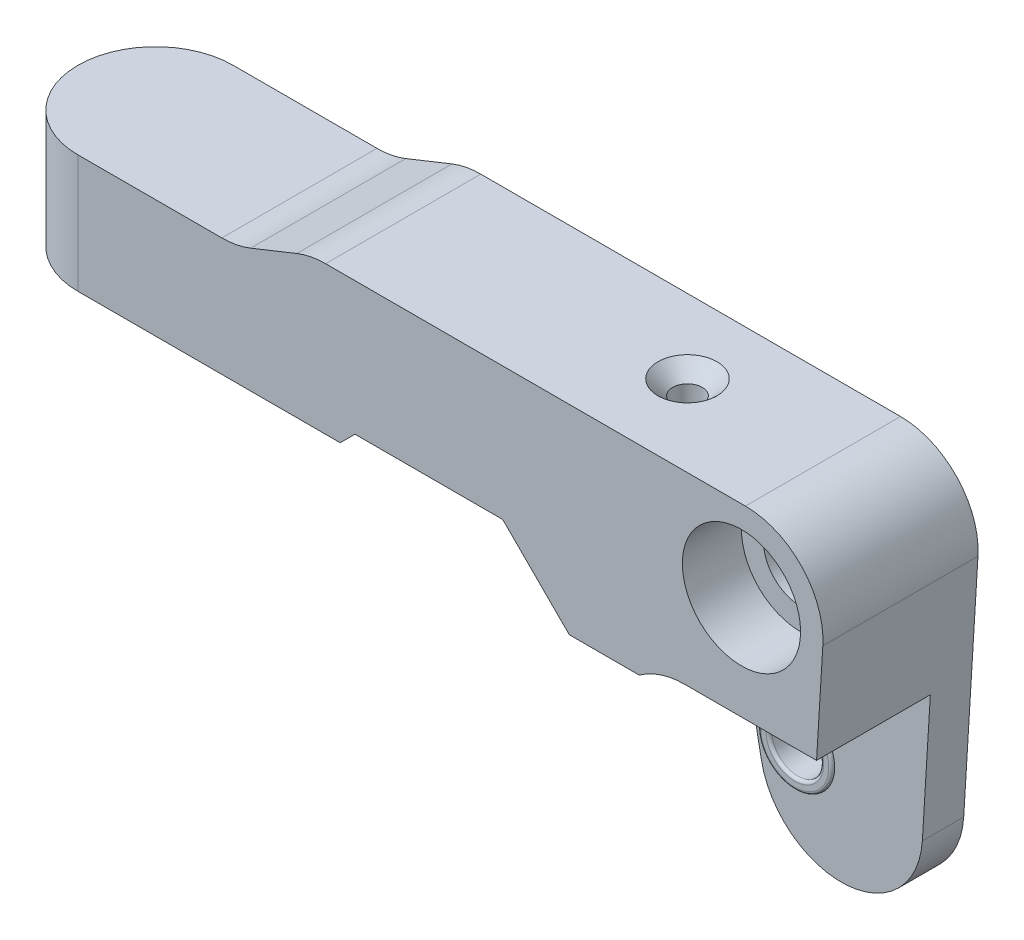
ISO-10303-21;
HEADER;
FILE_DESCRIPTION(('STEP AP214'),'2;1');
FILE_NAME('part.step','',(''),(''),'','','');
FILE_SCHEMA(('AUTOMOTIVE_DESIGN { 1 0 10303 214 1 1 1 1 }'));
ENDSEC;
DATA;
#1=APPLICATION_CONTEXT('core data for automotive mechanical design processes');
#2=APPLICATION_PROTOCOL_DEFINITION('international standard','automotive_design',2000,#1);
#3=PRODUCT_CONTEXT('',#1,'mechanical');
#4=PRODUCT('Part','Part','',(#3));
#5=PRODUCT_RELATED_PRODUCT_CATEGORY('part','',(#4));
#6=PRODUCT_DEFINITION_FORMATION('','',#4);
#7=PRODUCT_DEFINITION_CONTEXT('part definition',#1,'design');
#8=PRODUCT_DEFINITION('design','',#6,#7);
#9=PRODUCT_DEFINITION_SHAPE('','',#8);
#10=(LENGTH_UNIT() NAMED_UNIT(*) SI_UNIT(.MILLI.,.METRE.));
#11=(NAMED_UNIT(*) PLANE_ANGLE_UNIT() SI_UNIT($,.RADIAN.));
#12=(NAMED_UNIT(*) SI_UNIT($,.STERADIAN.) SOLID_ANGLE_UNIT());
#13=UNCERTAINTY_MEASURE_WITH_UNIT(LENGTH_MEASURE(1.E-05),#10,'distance_accuracy_value','');
#14=(GEOMETRIC_REPRESENTATION_CONTEXT(3) GLOBAL_UNCERTAINTY_ASSIGNED_CONTEXT((#13)) GLOBAL_UNIT_ASSIGNED_CONTEXT((#10,
#11,#12)) REPRESENTATION_CONTEXT('',''));
#15=CARTESIAN_POINT('',(0.,0.,0.));
#16=DIRECTION('',(0.,0.,1.));
#17=DIRECTION('',(1.,0.,0.));
#18=AXIS2_PLACEMENT_3D('',#15,#16,#17);
#19=CARTESIAN_POINT('',(-13.6533278103634,15.5,6.8));
#20=DIRECTION('',(0.,0.,1.));
#21=DIRECTION('',(1.,0.,0.));
#22=AXIS2_PLACEMENT_3D('',#19,#20,#21);
#23=PLANE('',#22);
#24=DIRECTION('',(-1.,0.,0.));
#25=VECTOR('',#24,1.);
#26=CARTESIAN_POINT('',(41.5821394377555,29.5,6.8));
#27=LINE('',#26,#25);
#28=CARTESIAN_POINT('',(41.5821394377555,29.5,6.8));
#29=VERTEX_POINT('',#28);
#30=CARTESIAN_POINT('',(32.66434643924,29.5,6.8));
#31=VERTEX_POINT('',#30);
#32=EDGE_CURVE('E170',#29,#31,#27,.T.);
#33=ORIENTED_EDGE('',*,*,#32,.T.);
#34=CARTESIAN_POINT('',(32.66434643924,24.25,6.8));
#35=DIRECTION('',(0.,0.,1.));
#36=DIRECTION('',(1.,0.,0.));
#37=AXIS2_PLACEMENT_3D('',#34,#35,#36);
#38=CIRCLE('',#37,5.25);
#39=CARTESIAN_POINT('',(29.5821394377555,28.5,6.8));
#40=VERTEX_POINT('',#39);
#41=EDGE_CURVE('E288',#31,#40,#38,.T.);
#42=ORIENTED_EDGE('',*,*,#41,.T.);
#43=DIRECTION('',(-1.,0.,0.));
#44=VECTOR('',#43,1.);
#45=CARTESIAN_POINT('',(29.5821394377555,28.5,6.8));
#46=LINE('',#45,#44);
#47=CARTESIAN_POINT('',(24.8466721896366,28.5,6.8));
#48=VERTEX_POINT('',#47);
#49=EDGE_CURVE('E187',#40,#48,#46,.T.);
#50=ORIENTED_EDGE('',*,*,#49,.T.);
#51=DIRECTION('',(0.707106781186546,-0.707106781186549,0.));
#52=VECTOR('',#51,1.);
#53=CARTESIAN_POINT('',(20.3466721896366,33.,6.8));
#54=LINE('',#53,#52);
#55=CARTESIAN_POINT('',(29.3830358119642,23.9636363776724,6.8));
#56=VERTEX_POINT('',#55);
#57=EDGE_CURVE('E178',#48,#56,#54,.T.);
#58=ORIENTED_EDGE('',*,*,#57,.T.);
#59=DIRECTION('',(0.188429749514115,-0.98208667107239,0.));
#60=VECTOR('',#59,1.);
#61=CARTESIAN_POINT('',(29.3830358119642,23.9636363776724,6.8));
#62=LINE('',#61,#60);
#63=CARTESIAN_POINT('',(30.1505026967693,19.9636363776724,6.8));
#64=VERTEX_POINT('',#63);
#65=EDGE_CURVE('E204',#56,#64,#62,.T.);
#66=ORIENTED_EDGE('',*,*,#65,.T.);
#67=CARTESIAN_POINT('',(35.5519793876674,21.,6.8));
#68=DIRECTION('',(0.,0.,1.));
#69=DIRECTION('',(1.,0.,0.));
#70=AXIS2_PLACEMENT_3D('',#67,#68,#69);
#71=CIRCLE('',#70,5.5);
#72=CARTESIAN_POINT('',(41.0417207789877,20.6642330325583,6.8));
#73=VERTEX_POINT('',#72);
#74=EDGE_CURVE('E173',#64,#73,#71,.T.);
#75=ORIENTED_EDGE('',*,*,#74,.T.);
#76=DIRECTION('',(0.0610485395348604,0.998134798421867,0.));
#77=VECTOR('',#76,1.);
#78=CARTESIAN_POINT('',(41.0417207789877,20.6642330325583,6.8));
#79=LINE('',#78,#77);
#80=EDGE_CURVE('E167',#73,#29,#79,.T.);
#81=ORIENTED_EDGE('',*,*,#80,.T.);
#82=EDGE_LOOP('',(#33,#42,#50,#58,#66,#75,#81));
#83=FACE_BOUND('',#82,.T.);
#84=CARTESIAN_POINT('',(32.6075359466494,22.,6.8));
#85=DIRECTION('',(0.,0.,1.));
#86=DIRECTION('',(1.,0.,0.));
#87=AXIS2_PLACEMENT_3D('',#84,#85,#86);
#88=CIRCLE('',#87,2.5);
#89=CARTESIAN_POINT('',(35.1075359466494,22.,6.8));
#90=VERTEX_POINT('',#89);
#91=EDGE_CURVE('E306',#90,#90,#88,.T.);
#92=ORIENTED_EDGE('',*,*,#91,.F.);
#93=EDGE_LOOP('',(#92));
#94=FACE_BOUND('',#93,.T.);
#95=ADVANCED_FACE('F30',(#83,#94),#23,.T.);
#96=CARTESIAN_POINT('',(29.3830358119642,23.9636363776724,14.5));
#97=DIRECTION('',(0.982086671072389,0.188429749514115,0.));
#98=DIRECTION('',(-0.188429749514115,0.98208667107239,0.));
#99=AXIS2_PLACEMENT_3D('',#96,#97,#98);
#100=PLANE('',#99);
#101=ORIENTED_EDGE('',*,*,#65,.F.);
#102=DIRECTION('',(0.,0.,-1.));
#103=VECTOR('',#102,1.);
#104=CARTESIAN_POINT('',(29.3830358119642,23.9636363776724,14.5));
#105=LINE('',#104,#103);
#106=CARTESIAN_POINT('',(29.3830358119642,23.9636363776724,4.));
#107=VERTEX_POINT('',#106);
#108=EDGE_CURVE('E250',#56,#107,#105,.T.);
#109=ORIENTED_EDGE('',*,*,#108,.T.);
#110=DIRECTION('',(0.188429749514115,-0.98208667107239,0.));
#111=VECTOR('',#110,1.);
#112=CARTESIAN_POINT('',(29.3830358119642,23.9636363776724,4.));
#113=LINE('',#112,#111);
#114=CARTESIAN_POINT('',(30.1505026967693,19.9636363776724,4.));
#115=VERTEX_POINT('',#114);
#116=EDGE_CURVE('E242',#107,#115,#113,.T.);
#117=ORIENTED_EDGE('',*,*,#116,.T.);
#118=DIRECTION('',(0.,0.,-1.));
#119=VECTOR('',#118,1.);
#120=CARTESIAN_POINT('',(30.1505026967693,19.9636363776724,14.5));
#121=LINE('',#120,#119);
#122=EDGE_CURVE('E248',#64,#115,#121,.T.);
#123=ORIENTED_EDGE('',*,*,#122,.F.);
#124=EDGE_LOOP('',(#101,#109,#117,#123));
#125=FACE_BOUND('',#124,.T.);
#126=ADVANCED_FACE('F412',(#125),#100,.F.);
#127=CARTESIAN_POINT('',(35.5519793876674,21.,14.5));
#128=DIRECTION('',(0.,0.,-1.));
#129=DIRECTION('',(-1.,0.,0.));
#130=AXIS2_PLACEMENT_3D('',#127,#128,#129);
#131=CYLINDRICAL_SURFACE('',#130,5.5);
#132=ORIENTED_EDGE('',*,*,#74,.F.);
#133=ORIENTED_EDGE('',*,*,#122,.T.);
#134=CARTESIAN_POINT('',(35.5519793876674,21.,4.));
#135=DIRECTION('',(0.,0.,1.));
#136=DIRECTION('',(1.,0.,0.));
#137=AXIS2_PLACEMENT_3D('',#134,#135,#136);
#138=CIRCLE('',#137,5.5);
#139=CARTESIAN_POINT('',(41.0417207789877,20.6642330325583,4.));
#140=VERTEX_POINT('',#139);
#141=EDGE_CURVE('E209',#115,#140,#138,.T.);
#142=ORIENTED_EDGE('',*,*,#141,.T.);
#143=DIRECTION('',(0.,0.,-1.));
#144=VECTOR('',#143,1.);
#145=CARTESIAN_POINT('',(41.0417207789877,20.6642330325583,14.5));
#146=LINE('',#145,#144);
#147=EDGE_CURVE('E224',#73,#140,#146,.T.);
#148=ORIENTED_EDGE('',*,*,#147,.F.);
#149=EDGE_LOOP('',(#132,#133,#142,#148));
#150=FACE_BOUND('',#149,.T.);
#151=ADVANCED_FACE('F417',(#150),#131,.T.);
#152=CARTESIAN_POINT('',(41.0417207789877,20.6642330325583,14.5));
#153=DIRECTION('',(-0.998134798421867,0.0610485395348604,0.));
#154=DIRECTION('',(-0.0610485395348604,-0.998134798421867,0.));
#155=AXIS2_PLACEMENT_3D('',#152,#153,#154);
#156=PLANE('',#155);
#157=DIRECTION('',(0.0610485395348604,0.998134798421867,0.));
#158=VECTOR('',#157,1.);
#159=CARTESIAN_POINT('',(41.0417207789877,20.6642330325583,4.));
#160=LINE('',#159,#158);
#161=CARTESIAN_POINT('',(42.0059655185164,36.429495167442,4.));
#162=VERTEX_POINT('',#161);
#163=EDGE_CURVE('E177',#140,#162,#160,.T.);
#164=ORIENTED_EDGE('',*,*,#163,.T.);
#165=DIRECTION('',(0.,0.,-1.));
#166=VECTOR('',#165,1.);
#167=CARTESIAN_POINT('',(42.0059655185164,36.429495167442,14.5));
#168=LINE('',#167,#166);
#169=CARTESIAN_POINT('',(42.0059655185164,36.429495167442,14.5));
#170=VERTEX_POINT('',#169);
#171=EDGE_CURVE('E290',#162,#170,#168,.F.);
#172=ORIENTED_EDGE('',*,*,#171,.T.);
#173=DIRECTION('',(0.0610485395348604,0.998134798421867,0.));
#174=VECTOR('',#173,1.);
#175=CARTESIAN_POINT('',(41.0417207789877,20.6642330325583,14.5));
#176=LINE('',#175,#174);
#177=CARTESIAN_POINT('',(41.5821394377555,29.5,14.5));
#178=VERTEX_POINT('',#177);
#179=EDGE_CURVE('E194',#178,#170,#176,.T.);
#180=ORIENTED_EDGE('',*,*,#179,.F.);
#181=DIRECTION('',(0.,0.,1.));
#182=VECTOR('',#181,1.);
#183=CARTESIAN_POINT('',(41.5821394377555,29.5,6.8));
#184=LINE('',#183,#182);
#185=EDGE_CURVE('E183',#29,#178,#184,.T.);
#186=ORIENTED_EDGE('',*,*,#185,.F.);
#187=ORIENTED_EDGE('',*,*,#80,.F.);
#188=ORIENTED_EDGE('',*,*,#147,.T.);
#189=EDGE_LOOP('',(#164,#172,#180,#186,#187,#188));
#190=FACE_BOUND('',#189,.T.);
#191=ADVANCED_FACE('F192',(#190),#156,.F.);
#192=CARTESIAN_POINT('',(42.3466721896366,42.,14.5));
#193=DIRECTION('',(0.,-1.,0.));
#194=DIRECTION('',(0.,0.,-1.));
#195=AXIS2_PLACEMENT_3D('',#192,#193,#194);
#196=PLANE('',#195);
#197=CARTESIAN_POINT('',(27.3466721896366,42.,9.));
#198=DIRECTION('',(0.,-1.,0.));
#199=DIRECTION('',(0.,0.,-1.));
#200=AXIS2_PLACEMENT_3D('',#197,#198,#199);
#201=CIRCLE('',#200,1.99999999999999);
#202=CARTESIAN_POINT('',(27.3466721896366,42.,7.00000000000001));
#203=VERTEX_POINT('',#202);
#204=EDGE_CURVE('E317',#203,#203,#201,.T.);
#205=ORIENTED_EDGE('',*,*,#204,.T.);
#206=EDGE_LOOP('',(#205));
#207=FACE_BOUND('',#206,.T.);
#208=DIRECTION('',(-1.,0.,0.));
#209=VECTOR('',#208,1.);
#210=CARTESIAN_POINT('',(42.3466721896366,42.,4.));
#211=LINE('',#210,#209);
#212=CARTESIAN_POINT('',(36.7657578268016,42.,4.));
#213=VERTEX_POINT('',#212);
#214=CARTESIAN_POINT('',(8.3577298083647,42.,4.));
#215=VERTEX_POINT('',#214);
#216=EDGE_CURVE('E226',#213,#215,#211,.T.);
#217=ORIENTED_EDGE('',*,*,#216,.T.);
#218=DIRECTION('',(0.,0.,-1.));
#219=VECTOR('',#218,1.);
#220=CARTESIAN_POINT('',(8.3577298083647,42.,14.5));
#221=LINE('',#220,#219);
#222=CARTESIAN_POINT('',(8.3577298083647,42.,14.5));
#223=VERTEX_POINT('',#222);
#224=EDGE_CURVE('E279',#215,#223,#221,.F.);
#225=ORIENTED_EDGE('',*,*,#224,.T.);
#226=DIRECTION('',(-1.,0.,0.));
#227=VECTOR('',#226,1.);
#228=CARTESIAN_POINT('',(42.3466721896366,42.,14.5));
#229=LINE('',#228,#227);
#230=CARTESIAN_POINT('',(36.7657578268016,42.,14.5));
#231=VERTEX_POINT('',#230);
#232=EDGE_CURVE('E208',#231,#223,#229,.T.);
#233=ORIENTED_EDGE('',*,*,#232,.F.);
#234=DIRECTION('',(0.,0.,-1.));
#235=VECTOR('',#234,1.);
#236=CARTESIAN_POINT('',(36.7657578268016,42.,14.5));
#237=LINE('',#236,#235);
#238=EDGE_CURVE('E276',#231,#213,#237,.T.);
#239=ORIENTED_EDGE('',*,*,#238,.T.);
#240=EDGE_LOOP('',(#217,#225,#233,#239));
#241=FACE_BOUND('',#240,.T.);
#242=ADVANCED_FACE('F453',(#207,#241),#196,.F.);
#243=CARTESIAN_POINT('',(7.34667218963663,42.,14.5));
#244=DIRECTION('',(0.371390676354103,-0.928476690885259,0.));
#245=DIRECTION('',(0.92847669088526,0.371390676354103,0.));
#246=AXIS2_PLACEMENT_3D('',#243,#244,#245);
#247=PLANE('',#246);
#248=DIRECTION('',(-0.92847669088526,-0.371390676354103,0.));
#249=VECTOR('',#248,1.);
#250=CARTESIAN_POINT('',(7.34667218963663,42.,4.));
#251=LINE('',#250,#249);
#252=CARTESIAN_POINT('',(6.40792875750565,41.6245026271476,4.));
#253=VERTEX_POINT('',#252);
#254=CARTESIAN_POINT('',(3.28541562176761,40.3754973728524,4.));
#255=VERTEX_POINT('',#254);
#256=EDGE_CURVE('E229',#253,#255,#251,.T.);
#257=ORIENTED_EDGE('',*,*,#256,.T.);
#258=DIRECTION('',(0.,0.,-1.));
#259=VECTOR('',#258,1.);
#260=CARTESIAN_POINT('',(3.28541562176761,40.3754973728524,14.5));
#261=LINE('',#260,#259);
#262=CARTESIAN_POINT('',(3.28541562176761,40.3754973728524,14.5));
#263=VERTEX_POINT('',#262);
#264=EDGE_CURVE('E267',#255,#263,#261,.F.);
#265=ORIENTED_EDGE('',*,*,#264,.T.);
#266=DIRECTION('',(-0.92847669088526,-0.371390676354103,0.));
#267=VECTOR('',#266,1.);
#268=CARTESIAN_POINT('',(7.34667218963663,42.,14.5));
#269=LINE('',#268,#267);
#270=CARTESIAN_POINT('',(6.40792875750565,41.6245026271476,14.5));
#271=VERTEX_POINT('',#270);
#272=EDGE_CURVE('E212',#271,#263,#269,.T.);
#273=ORIENTED_EDGE('',*,*,#272,.F.);
#274=DIRECTION('',(0.,0.,-1.));
#275=VECTOR('',#274,1.);
#276=CARTESIAN_POINT('',(6.40792875750565,41.6245026271476,14.5));
#277=LINE('',#276,#275);
#278=EDGE_CURVE('E264',#271,#253,#277,.T.);
#279=ORIENTED_EDGE('',*,*,#278,.T.);
#280=EDGE_LOOP('',(#257,#265,#273,#279));
#281=FACE_BOUND('',#280,.T.);
#282=ADVANCED_FACE('F449',(#281),#247,.F.);
#283=CARTESIAN_POINT('',(2.34667218963663,40.,14.5));
#284=DIRECTION('',(0.,-1.,0.));
#285=DIRECTION('',(1.,0.,0.));
#286=AXIS2_PLACEMENT_3D('',#283,#284,#285);
#287=PLANE('',#286);
#288=DIRECTION('',(-1.,0.,0.));
#289=VECTOR('',#288,1.);
#290=CARTESIAN_POINT('',(2.34667218963663,40.,14.5));
#291=LINE('',#290,#289);
#292=CARTESIAN_POINT('',(1.33561457090857,40.,14.5));
#293=VERTEX_POINT('',#292);
#294=CARTESIAN_POINT('',(-8.40332781036337,40.,14.5));
#295=VERTEX_POINT('',#294);
#296=EDGE_CURVE('E215',#293,#295,#291,.T.);
#297=ORIENTED_EDGE('',*,*,#296,.F.);
#298=DIRECTION('',(0.,0.,-1.));
#299=VECTOR('',#298,1.);
#300=CARTESIAN_POINT('',(1.33561457090857,40.,4.));
#301=LINE('',#300,#299);
#302=CARTESIAN_POINT('',(1.33561457090857,40.,4.));
#303=VERTEX_POINT('',#302);
#304=EDGE_CURVE('E261',#293,#303,#301,.T.);
#305=ORIENTED_EDGE('',*,*,#304,.T.);
#306=DIRECTION('',(-1.,0.,0.));
#307=VECTOR('',#306,1.);
#308=CARTESIAN_POINT('',(2.34667218963663,40.,4.));
#309=LINE('',#308,#307);
#310=CARTESIAN_POINT('',(-8.40332781036337,40.,4.));
#311=VERTEX_POINT('',#310);
#312=EDGE_CURVE('E232',#303,#311,#309,.T.);
#313=ORIENTED_EDGE('',*,*,#312,.T.);
#314=CARTESIAN_POINT('',(-8.40332781036337,40.,9.25));
#315=DIRECTION('',(0.,-1.,0.));
#316=DIRECTION('',(1.,0.,0.));
#317=AXIS2_PLACEMENT_3D('',#314,#315,#316);
#318=CIRCLE('',#317,5.25);
#319=CARTESIAN_POINT('',(-13.6533278103634,40.,9.25));
#320=VERTEX_POINT('',#319);
#321=EDGE_CURVE('E259',#311,#320,#318,.F.);
#322=ORIENTED_EDGE('',*,*,#321,.T.);
#323=CARTESIAN_POINT('',(-8.40332781036337,40.,9.25));
#324=DIRECTION('',(0.,-1.,0.));
#325=DIRECTION('',(1.,0.,0.));
#326=AXIS2_PLACEMENT_3D('',#323,#324,#325);
#327=CIRCLE('',#326,5.25);
#328=EDGE_CURVE('E257',#320,#295,#327,.F.);
#329=ORIENTED_EDGE('',*,*,#328,.T.);
#330=EDGE_LOOP('',(#297,#305,#313,#322,#329));
#331=FACE_BOUND('',#330,.T.);
#332=ADVANCED_FACE('F445',(#331),#287,.F.);
#333=CARTESIAN_POINT('',(-13.6533278103634,32.,14.5));
#334=DIRECTION('',(0.,1.,0.));
#335=DIRECTION('',(0.,0.,1.));
#336=AXIS2_PLACEMENT_3D('',#333,#334,#335);
#337=PLANE('',#336);
#338=CARTESIAN_POINT('',(6.59458871160727,32.,9.5));
#339=DIRECTION('',(0.,1.,0.));
#340=DIRECTION('',(0.,0.,1.));
#341=AXIS2_PLACEMENT_3D('',#338,#339,#340);
#342=CIRCLE('',#341,1.45);
#343=CARTESIAN_POINT('',(6.59458871160727,32.,10.95));
#344=VERTEX_POINT('',#343);
#345=EDGE_CURVE('E348',#344,#344,#342,.T.);
#346=ORIENTED_EDGE('',*,*,#345,.T.);
#347=EDGE_LOOP('',(#346));
#348=FACE_BOUND('',#347,.T.);
#349=CARTESIAN_POINT('',(-8.40332781036337,32.,9.25));
#350=DIRECTION('',(0.,1.,0.));
#351=DIRECTION('',(0.,0.,1.));
#352=AXIS2_PLACEMENT_3D('',#349,#350,#351);
#353=CIRCLE('',#352,5.25);
#354=CARTESIAN_POINT('',(-8.40332781036337,32.,14.5));
#355=VERTEX_POINT('',#354);
#356=CARTESIAN_POINT('',(-13.6533278103634,32.,9.25));
#357=VERTEX_POINT('',#356);
#358=EDGE_CURVE('E292',#355,#357,#353,.F.);
#359=ORIENTED_EDGE('',*,*,#358,.T.);
#360=CARTESIAN_POINT('',(-8.40332781036336,32.,9.25));
#361=DIRECTION('',(0.,1.,0.));
#362=DIRECTION('',(0.,0.,1.));
#363=AXIS2_PLACEMENT_3D('',#360,#361,#362);
#364=CIRCLE('',#363,5.25);
#365=CARTESIAN_POINT('',(-8.40332781036336,32.,4.));
#366=VERTEX_POINT('',#365);
#367=EDGE_CURVE('E294',#357,#366,#364,.F.);
#368=ORIENTED_EDGE('',*,*,#367,.T.);
#369=DIRECTION('',(1.,0.,0.));
#370=VECTOR('',#369,1.);
#371=CARTESIAN_POINT('',(-13.6533278103634,32.,4.));
#372=LINE('',#371,#370);
#373=CARTESIAN_POINT('',(9.34667218963663,32.,4.));
#374=VERTEX_POINT('',#373);
#375=EDGE_CURVE('E235',#366,#374,#372,.T.);
#376=ORIENTED_EDGE('',*,*,#375,.T.);
#377=DIRECTION('',(0.,0.,-1.));
#378=VECTOR('',#377,1.);
#379=CARTESIAN_POINT('',(9.34667218963663,32.,14.5));
#380=LINE('',#379,#378);
#381=CARTESIAN_POINT('',(9.34667218963663,32.,14.5));
#382=VERTEX_POINT('',#381);
#383=EDGE_CURVE('E253',#382,#374,#380,.T.);
#384=ORIENTED_EDGE('',*,*,#383,.F.);
#385=DIRECTION('',(1.,0.,0.));
#386=VECTOR('',#385,1.);
#387=CARTESIAN_POINT('',(-13.6533278103634,32.,14.5));
#388=LINE('',#387,#386);
#389=EDGE_CURVE('E218',#355,#382,#388,.T.);
#390=ORIENTED_EDGE('',*,*,#389,.F.);
#391=EDGE_LOOP('',(#359,#368,#376,#384,#390));
#392=FACE_BOUND('',#391,.T.);
#393=ADVANCED_FACE('F442',(#348,#392),#337,.F.);
#394=CARTESIAN_POINT('',(9.34667218963663,33.,14.5));
#395=DIRECTION('',(0.,1.,0.));
#396=DIRECTION('',(0.,0.,1.));
#397=AXIS2_PLACEMENT_3D('',#394,#395,#396);
#398=PLANE('',#397);
#399=DIRECTION('',(1.,0.,0.));
#400=VECTOR('',#399,1.);
#401=CARTESIAN_POINT('',(9.34667218963663,33.,4.));
#402=LINE('',#401,#400);
#403=CARTESIAN_POINT('',(10.3466721896366,33.,4.));
#404=VERTEX_POINT('',#403);
#405=CARTESIAN_POINT('',(20.263829477162,33.,4.));
#406=VERTEX_POINT('',#405);
#407=EDGE_CURVE('E238',#404,#406,#402,.T.);
#408=ORIENTED_EDGE('',*,*,#407,.T.);
#409=DIRECTION('',(0.,0.,-1.));
#410=VECTOR('',#409,1.);
#411=CARTESIAN_POINT('',(20.263829477162,33.,14.5));
#412=LINE('',#411,#410);
#413=CARTESIAN_POINT('',(20.263829477162,33.,14.5));
#414=VERTEX_POINT('',#413);
#415=EDGE_CURVE('E45',#406,#414,#412,.F.);
#416=ORIENTED_EDGE('',*,*,#415,.T.);
#417=DIRECTION('',(1.,0.,0.));
#418=VECTOR('',#417,1.);
#419=CARTESIAN_POINT('',(9.34667218963663,33.,14.5));
#420=LINE('',#419,#418);
#421=CARTESIAN_POINT('',(10.3466721896366,33.,14.5));
#422=VERTEX_POINT('',#421);
#423=EDGE_CURVE('E220',#422,#414,#420,.T.);
#424=ORIENTED_EDGE('',*,*,#423,.F.);
#425=DIRECTION('',(0.,0.,-1.));
#426=VECTOR('',#425,1.);
#427=CARTESIAN_POINT('',(10.3466721896366,33.,4.));
#428=LINE('',#427,#426);
#429=EDGE_CURVE('E302',#422,#404,#428,.T.);
#430=ORIENTED_EDGE('',*,*,#429,.T.);
#431=EDGE_LOOP('',(#408,#416,#424,#430));
#432=FACE_BOUND('',#431,.T.);
#433=ADVANCED_FACE('F358',(#432),#398,.F.);
#434=CARTESIAN_POINT('',(20.3466721896366,33.,14.5));
#435=DIRECTION('',(0.707106781186549,0.707106781186546,0.));
#436=DIRECTION('',(-0.707106781186546,0.707106781186549,0.));
#437=AXIS2_PLACEMENT_3D('',#434,#435,#436);
#438=PLANE('',#437);
#439=DIRECTION('',(0.707106781186546,-0.707106781186549,0.));
#440=VECTOR('',#439,1.);
#441=CARTESIAN_POINT('',(20.3466721896366,33.,14.5));
#442=LINE('',#441,#440);
#443=CARTESIAN_POINT('',(20.4052508333993,32.9414213562373,14.5));
#444=VERTEX_POINT('',#443);
#445=CARTESIAN_POINT('',(24.8466721896366,28.5,14.5));
#446=VERTEX_POINT('',#445);
#447=EDGE_CURVE('E222',#444,#446,#442,.T.);
#448=ORIENTED_EDGE('',*,*,#447,.F.);
#449=DIRECTION('',(0.,0.,-1.));
#450=VECTOR('',#449,1.);
#451=CARTESIAN_POINT('',(20.4052508333993,32.9414213562373,4.));
#452=LINE('',#451,#450);
#453=CARTESIAN_POINT('',(20.4052508333993,32.9414213562373,4.));
#454=VERTEX_POINT('',#453);
#455=EDGE_CURVE('E335',#444,#454,#452,.T.);
#456=ORIENTED_EDGE('',*,*,#455,.T.);
#457=DIRECTION('',(0.707106781186546,-0.707106781186549,0.));
#458=VECTOR('',#457,1.);
#459=CARTESIAN_POINT('',(20.3466721896366,33.,4.));
#460=LINE('',#459,#458);
#461=EDGE_CURVE('E240',#454,#107,#460,.T.);
#462=ORIENTED_EDGE('',*,*,#461,.T.);
#463=ORIENTED_EDGE('',*,*,#108,.F.);
#464=ORIENTED_EDGE('',*,*,#57,.F.);
#465=DIRECTION('',(0.,0.,1.));
#466=VECTOR('',#465,1.);
#467=CARTESIAN_POINT('',(24.8466721896366,28.5,6.8));
#468=LINE('',#467,#466);
#469=EDGE_CURVE('E198',#48,#446,#468,.T.);
#470=ORIENTED_EDGE('',*,*,#469,.T.);
#471=EDGE_LOOP('',(#448,#456,#462,#463,#464,#470));
#472=FACE_BOUND('',#471,.T.);
#473=ADVANCED_FACE('F362',(#472),#438,.F.);
#474=CARTESIAN_POINT('',(35.5519793876674,21.,14.5));
#475=DIRECTION('',(0.,0.,1.));
#476=DIRECTION('',(1.,0.,0.));
#477=AXIS2_PLACEMENT_3D('',#474,#475,#476);
#478=PLANE('',#477);
#479=CARTESIAN_POINT('',(36.5,36.5,14.5));
#480=DIRECTION('',(0.,0.,1.));
#481=DIRECTION('',(1.,0.,0.));
#482=AXIS2_PLACEMENT_3D('',#479,#480,#481);
#483=CIRCLE('',#482,4.00000000000001);
#484=CARTESIAN_POINT('',(40.5,36.5,14.5));
#485=VERTEX_POINT('',#484);
#486=EDGE_CURVE('E378',#485,#485,#483,.T.);
#487=ORIENTED_EDGE('',*,*,#486,.F.);
#488=EDGE_LOOP('',(#487));
#489=FACE_BOUND('',#488,.T.);
#490=ORIENTED_EDGE('',*,*,#232,.T.);
#491=CARTESIAN_POINT('',(8.35772980836469,36.75,14.5));
#492=DIRECTION('',(0.,0.,1.));
#493=DIRECTION('',(1.,0.,0.));
#494=AXIS2_PLACEMENT_3D('',#491,#492,#493);
#495=CIRCLE('',#494,5.25);
#496=EDGE_CURVE('E285',#223,#271,#495,.T.);
#497=ORIENTED_EDGE('',*,*,#496,.T.);
#498=ORIENTED_EDGE('',*,*,#272,.T.);
#499=CARTESIAN_POINT('',(1.33561457090857,45.25,14.5));
#500=DIRECTION('',(0.,0.,1.));
#501=DIRECTION('',(1.,0.,0.));
#502=AXIS2_PLACEMENT_3D('',#499,#500,#501);
#503=CIRCLE('',#502,5.25);
#504=EDGE_CURVE('E298',#263,#293,#503,.F.);
#505=ORIENTED_EDGE('',*,*,#504,.T.);
#506=ORIENTED_EDGE('',*,*,#296,.T.);
#507=DIRECTION('',(0.,-1.,0.));
#508=VECTOR('',#507,1.);
#509=CARTESIAN_POINT('',(-8.40332781036337,32.,14.5));
#510=LINE('',#509,#508);
#511=EDGE_CURVE('E281',#295,#355,#510,.T.);
#512=ORIENTED_EDGE('',*,*,#511,.T.);
#513=ORIENTED_EDGE('',*,*,#389,.T.);
#514=DIRECTION('',(-0.707106781186552,-0.707106781186543,0.));
#515=VECTOR('',#514,1.);
#516=CARTESIAN_POINT('',(10.3466721896366,33.,14.5));
#517=LINE('',#516,#515);
#518=EDGE_CURVE('E312',#382,#422,#517,.F.);
#519=ORIENTED_EDGE('',*,*,#518,.T.);
#520=ORIENTED_EDGE('',*,*,#423,.T.);
#521=CARTESIAN_POINT('',(20.263829477162,32.8,14.5));
#522=DIRECTION('',(0.,0.,1.));
#523=DIRECTION('',(1.,0.,0.));
#524=AXIS2_PLACEMENT_3D('',#521,#522,#523);
#525=CIRCLE('',#524,0.2);
#526=EDGE_CURVE('E11',#414,#444,#525,.F.);
#527=ORIENTED_EDGE('',*,*,#526,.T.);
#528=ORIENTED_EDGE('',*,*,#447,.T.);
#529=DIRECTION('',(-1.,0.,0.));
#530=VECTOR('',#529,1.);
#531=CARTESIAN_POINT('',(29.5821394377555,28.5,14.5));
#532=LINE('',#531,#530);
#533=CARTESIAN_POINT('',(29.5821394377555,28.5,14.5));
#534=VERTEX_POINT('',#533);
#535=EDGE_CURVE('E188',#534,#446,#532,.T.);
#536=ORIENTED_EDGE('',*,*,#535,.F.);
#537=CARTESIAN_POINT('',(32.66434643924,24.25,14.5));
#538=DIRECTION('',(0.,0.,1.));
#539=DIRECTION('',(1.,0.,0.));
#540=AXIS2_PLACEMENT_3D('',#537,#538,#539);
#541=CIRCLE('',#540,5.25);
#542=CARTESIAN_POINT('',(32.66434643924,29.5,14.5));
#543=VERTEX_POINT('',#542);
#544=EDGE_CURVE('E300',#534,#543,#541,.F.);
#545=ORIENTED_EDGE('',*,*,#544,.T.);
#546=DIRECTION('',(-1.,0.,0.));
#547=VECTOR('',#546,1.);
#548=CARTESIAN_POINT('',(41.5821394377555,29.5,14.5));
#549=LINE('',#548,#547);
#550=EDGE_CURVE('E373',#178,#543,#549,.T.);
#551=ORIENTED_EDGE('',*,*,#550,.F.);
#552=ORIENTED_EDGE('',*,*,#179,.T.);
#553=CARTESIAN_POINT('',(36.7657578268016,36.75,14.5));
#554=DIRECTION('',(0.,0.,1.));
#555=DIRECTION('',(1.,0.,0.));
#556=AXIS2_PLACEMENT_3D('',#553,#554,#555);
#557=CIRCLE('',#556,5.25);
#558=EDGE_CURVE('E283',#170,#231,#557,.T.);
#559=ORIENTED_EDGE('',*,*,#558,.T.);
#560=EDGE_LOOP('',(#490,#497,#498,#505,#506,#512,#513,#519,#520,#527,#528,#536,#545,#551,#552,#559));
#561=FACE_BOUND('',#560,.T.);
#562=ADVANCED_FACE('F368',(#489,#561),#478,.T.);
#563=CARTESIAN_POINT('',(35.5519793876674,21.,4.));
#564=DIRECTION('',(0.,0.,1.));
#565=DIRECTION('',(1.,0.,0.));
#566=AXIS2_PLACEMENT_3D('',#563,#564,#565);
#567=PLANE('',#566);
#568=CARTESIAN_POINT('',(32.6075359466494,22.,4.));
#569=DIRECTION('',(0.,0.,1.));
#570=DIRECTION('',(1.,0.,0.));
#571=AXIS2_PLACEMENT_3D('',#568,#569,#570);
#572=CIRCLE('',#571,1.95);
#573=CARTESIAN_POINT('',(34.5575359466494,22.,4.));
#574=VERTEX_POINT('',#573);
#575=EDGE_CURVE('E332',#574,#574,#572,.T.);
#576=ORIENTED_EDGE('',*,*,#575,.T.);
#577=EDGE_LOOP('',(#576));
#578=FACE_BOUND('',#577,.T.);
#579=CARTESIAN_POINT('',(36.5,36.5,4.));
#580=DIRECTION('',(0.,0.,1.));
#581=DIRECTION('',(1.,0.,0.));
#582=AXIS2_PLACEMENT_3D('',#579,#580,#581);
#583=CIRCLE('',#582,2.5);
#584=CARTESIAN_POINT('',(39.,36.5,4.));
#585=VERTEX_POINT('',#584);
#586=EDGE_CURVE('E381',#585,#585,#583,.T.);
#587=ORIENTED_EDGE('',*,*,#586,.T.);
#588=EDGE_LOOP('',(#587));
#589=FACE_BOUND('',#588,.T.);
#590=ORIENTED_EDGE('',*,*,#256,.F.);
#591=CARTESIAN_POINT('',(8.35772980836469,36.75,4.));
#592=DIRECTION('',(0.,0.,1.));
#593=DIRECTION('',(1.,0.,0.));
#594=AXIS2_PLACEMENT_3D('',#591,#592,#593);
#595=CIRCLE('',#594,5.25);
#596=EDGE_CURVE('E274',#253,#215,#595,.F.);
#597=ORIENTED_EDGE('',*,*,#596,.T.);
#598=ORIENTED_EDGE('',*,*,#216,.F.);
#599=CARTESIAN_POINT('',(36.7657578268016,36.75,4.));
#600=DIRECTION('',(0.,0.,1.));
#601=DIRECTION('',(1.,0.,0.));
#602=AXIS2_PLACEMENT_3D('',#599,#600,#601);
#603=CIRCLE('',#602,5.25);
#604=EDGE_CURVE('E272',#213,#162,#603,.F.);
#605=ORIENTED_EDGE('',*,*,#604,.T.);
#606=ORIENTED_EDGE('',*,*,#163,.F.);
#607=ORIENTED_EDGE('',*,*,#141,.F.);
#608=ORIENTED_EDGE('',*,*,#116,.F.);
#609=ORIENTED_EDGE('',*,*,#461,.F.);
#610=CARTESIAN_POINT('',(20.263829477162,32.8,4.));
#611=DIRECTION('',(0.,0.,1.));
#612=DIRECTION('',(1.,0.,0.));
#613=AXIS2_PLACEMENT_3D('',#610,#611,#612);
#614=CIRCLE('',#613,0.2);
#615=EDGE_CURVE('E38',#454,#406,#614,.T.);
#616=ORIENTED_EDGE('',*,*,#615,.T.);
#617=ORIENTED_EDGE('',*,*,#407,.F.);
#618=DIRECTION('',(0.707106781186552,0.707106781186543,0.));
#619=VECTOR('',#618,1.);
#620=CARTESIAN_POINT('',(16.9493257886522,39.6026535990155,4.));
#621=LINE('',#620,#619);
#622=EDGE_CURVE('E310',#404,#374,#621,.F.);
#623=ORIENTED_EDGE('',*,*,#622,.T.);
#624=ORIENTED_EDGE('',*,*,#375,.F.);
#625=DIRECTION('',(0.,-1.,0.));
#626=VECTOR('',#625,1.);
#627=CARTESIAN_POINT('',(-8.40332781036337,21.,4.));
#628=LINE('',#627,#626);
#629=EDGE_CURVE('E269',#366,#311,#628,.F.);
#630=ORIENTED_EDGE('',*,*,#629,.T.);
#631=ORIENTED_EDGE('',*,*,#312,.F.);
#632=CARTESIAN_POINT('',(1.33561457090857,45.25,4.));
#633=DIRECTION('',(0.,0.,1.));
#634=DIRECTION('',(1.,0.,0.));
#635=AXIS2_PLACEMENT_3D('',#632,#633,#634);
#636=CIRCLE('',#635,5.25);
#637=EDGE_CURVE('E296',#303,#255,#636,.T.);
#638=ORIENTED_EDGE('',*,*,#637,.T.);
#639=EDGE_LOOP('',(#590,#597,#598,#605,#606,#607,#608,#609,#616,#617,#623,#624,#630,#631,#638));
#640=FACE_BOUND('',#639,.T.);
#641=ADVANCED_FACE('F354',(#578,#589,#640),#567,.F.);
#642=CARTESIAN_POINT('',(29.5821394377555,28.5,6.8));
#643=DIRECTION('',(0.,1.,0.));
#644=DIRECTION('',(0.,0.,1.));
#645=AXIS2_PLACEMENT_3D('',#642,#643,#644);
#646=PLANE('',#645);
#647=CARTESIAN_POINT('',(27.3466721896366,28.5,9.));
#648=DIRECTION('',(0.,1.,0.));
#649=DIRECTION('',(0.,0.,1.));
#650=AXIS2_PLACEMENT_3D('',#647,#648,#649);
#651=CIRCLE('',#650,1.2);
#652=CARTESIAN_POINT('',(27.3466721896366,28.5,10.2));
#653=VERTEX_POINT('',#652);
#654=EDGE_CURVE('E339',#653,#653,#651,.T.);
#655=ORIENTED_EDGE('',*,*,#654,.T.);
#656=EDGE_LOOP('',(#655));
#657=FACE_BOUND('',#656,.T.);
#658=ORIENTED_EDGE('',*,*,#535,.T.);
#659=ORIENTED_EDGE('',*,*,#469,.F.);
#660=ORIENTED_EDGE('',*,*,#49,.F.);
#661=DIRECTION('',(0.,0.,1.));
#662=VECTOR('',#661,1.);
#663=CARTESIAN_POINT('',(29.5821394377555,28.5,6.8));
#664=LINE('',#663,#662);
#665=EDGE_CURVE('E195',#40,#534,#664,.T.);
#666=ORIENTED_EDGE('',*,*,#665,.T.);
#667=EDGE_LOOP('',(#658,#659,#660,#666));
#668=FACE_BOUND('',#667,.T.);
#669=ADVANCED_FACE('F370',(#657,#668),#646,.F.);
#670=CARTESIAN_POINT('',(41.5821394377555,29.5,6.8));
#671=DIRECTION('',(0.,1.,0.));
#672=DIRECTION('',(-1.,0.,0.));
#673=AXIS2_PLACEMENT_3D('',#670,#671,#672);
#674=PLANE('',#673);
#675=ORIENTED_EDGE('',*,*,#550,.T.);
#676=DIRECTION('',(0.,0.,-1.));
#677=VECTOR('',#676,1.);
#678=CARTESIAN_POINT('',(32.66434643924,29.5,6.8));
#679=LINE('',#678,#677);
#680=EDGE_CURVE('E186',#543,#31,#679,.T.);
#681=ORIENTED_EDGE('',*,*,#680,.T.);
#682=ORIENTED_EDGE('',*,*,#32,.F.);
#683=ORIENTED_EDGE('',*,*,#185,.T.);
#684=EDGE_LOOP('',(#675,#681,#682,#683));
#685=FACE_BOUND('',#684,.T.);
#686=ADVANCED_FACE('F182',(#685),#674,.F.);
#687=CARTESIAN_POINT('',(36.5,36.5,10.5));
#688=DIRECTION('',(0.,0.,1.));
#689=DIRECTION('',(1.,0.,0.));
#690=AXIS2_PLACEMENT_3D('',#687,#688,#689);
#691=CYLINDRICAL_SURFACE('',#690,4.00000000000001);
#692=CARTESIAN_POINT('',(36.5,36.5,10.5));
#693=DIRECTION('',(0.,0.,1.));
#694=DIRECTION('',(1.,0.,0.));
#695=AXIS2_PLACEMENT_3D('',#692,#693,#694);
#696=CIRCLE('',#695,4.00000000000001);
#697=CARTESIAN_POINT('',(40.5,36.5,10.5));
#698=VERTEX_POINT('',#697);
#699=EDGE_CURVE('E375',#698,#698,#696,.T.);
#700=ORIENTED_EDGE('',*,*,#699,.F.);
#701=EDGE_LOOP('',(#700));
#702=FACE_BOUND('',#701,.T.);
#703=ORIENTED_EDGE('',*,*,#486,.T.);
#704=EDGE_LOOP('',(#703));
#705=FACE_BOUND('',#704,.T.);
#706=ADVANCED_FACE('F422',(#702,#705),#691,.F.);
#707=CARTESIAN_POINT('',(36.5,36.5,10.5));
#708=DIRECTION('',(0.,0.,1.));
#709=DIRECTION('',(1.,0.,0.));
#710=AXIS2_PLACEMENT_3D('',#707,#708,#709);
#711=PLANE('',#710);
#712=CARTESIAN_POINT('',(36.5,36.5,10.5));
#713=DIRECTION('',(0.,0.,1.));
#714=DIRECTION('',(1.,0.,0.));
#715=AXIS2_PLACEMENT_3D('',#712,#713,#714);
#716=CIRCLE('',#715,2.5);
#717=CARTESIAN_POINT('',(39.,36.5,10.5));
#718=VERTEX_POINT('',#717);
#719=EDGE_CURVE('E384',#718,#718,#716,.T.);
#720=ORIENTED_EDGE('',*,*,#719,.F.);
#721=EDGE_LOOP('',(#720));
#722=FACE_BOUND('',#721,.T.);
#723=ORIENTED_EDGE('',*,*,#699,.T.);
#724=EDGE_LOOP('',(#723));
#725=FACE_BOUND('',#724,.T.);
#726=ADVANCED_FACE('F528',(#722,#725),#711,.T.);
#727=CARTESIAN_POINT('',(36.5,36.5,4.));
#728=DIRECTION('',(0.,0.,1.));
#729=DIRECTION('',(1.,0.,0.));
#730=AXIS2_PLACEMENT_3D('',#727,#728,#729);
#731=CYLINDRICAL_SURFACE('',#730,2.5);
#732=ORIENTED_EDGE('',*,*,#586,.F.);
#733=EDGE_LOOP('',(#732));
#734=FACE_BOUND('',#733,.T.);
#735=ORIENTED_EDGE('',*,*,#719,.T.);
#736=EDGE_LOOP('',(#735));
#737=FACE_BOUND('',#736,.T.);
#738=ADVANCED_FACE('F525',(#734,#737),#731,.F.);
#739=CARTESIAN_POINT('',(32.6075359466494,22.,4.));
#740=DIRECTION('',(0.,0.,1.));
#741=DIRECTION('',(1.,0.,0.));
#742=AXIS2_PLACEMENT_3D('',#739,#740,#741);
#743=CYLINDRICAL_SURFACE('',#742,1.75);
#744=CARTESIAN_POINT('',(32.6075359466494,22.,6.8));
#745=DIRECTION('',(0.,0.,1.));
#746=DIRECTION('',(1.,0.,0.));
#747=AXIS2_PLACEMENT_3D('',#744,#745,#746);
#748=CIRCLE('',#747,1.75);
#749=CARTESIAN_POINT('',(34.3575359466494,22.,6.8));
#750=VERTEX_POINT('',#749);
#751=EDGE_CURVE('E323',#750,#750,#748,.T.);
#752=ORIENTED_EDGE('',*,*,#751,.T.);
#753=EDGE_LOOP('',(#752));
#754=FACE_BOUND('',#753,.T.);
#755=CARTESIAN_POINT('',(32.6075359466494,22.,4.2));
#756=DIRECTION('',(0.,0.,1.));
#757=DIRECTION('',(1.,0.,0.));
#758=AXIS2_PLACEMENT_3D('',#755,#756,#757);
#759=CIRCLE('',#758,1.75);
#760=CARTESIAN_POINT('',(34.3575359466494,22.,4.2));
#761=VERTEX_POINT('',#760);
#762=EDGE_CURVE('E320',#761,#761,#759,.F.);
#763=ORIENTED_EDGE('',*,*,#762,.T.);
#764=EDGE_LOOP('',(#763));
#765=FACE_BOUND('',#764,.T.);
#766=ADVANCED_FACE('F519',(#754,#765),#743,.F.);
#767=CARTESIAN_POINT('',(32.6075359466494,22.,7.));
#768=DIRECTION('',(0.,0.,1.));
#769=DIRECTION('',(1.,0.,0.));
#770=AXIS2_PLACEMENT_3D('',#767,#768,#769);
#771=PLANE('',#770);
#772=CARTESIAN_POINT('',(32.6075359466494,22.,7.));
#773=DIRECTION('',(0.,0.,1.));
#774=DIRECTION('',(1.,0.,0.));
#775=AXIS2_PLACEMENT_3D('',#772,#773,#774);
#776=CIRCLE('',#775,1.95);
#777=CARTESIAN_POINT('',(34.5575359466494,22.,7.));
#778=VERTEX_POINT('',#777);
#779=EDGE_CURVE('E329',#778,#778,#776,.F.);
#780=ORIENTED_EDGE('',*,*,#779,.T.);
#781=EDGE_LOOP('',(#780));
#782=FACE_BOUND('',#781,.T.);
#783=CARTESIAN_POINT('',(32.6075359466494,22.,7.));
#784=DIRECTION('',(0.,0.,1.));
#785=DIRECTION('',(1.,0.,0.));
#786=AXIS2_PLACEMENT_3D('',#783,#784,#785);
#787=CIRCLE('',#786,2.3);
#788=CARTESIAN_POINT('',(34.9075359466494,22.,7.));
#789=VERTEX_POINT('',#788);
#790=EDGE_CURVE('E326',#789,#789,#787,.T.);
#791=ORIENTED_EDGE('',*,*,#790,.T.);
#792=EDGE_LOOP('',(#791));
#793=FACE_BOUND('',#792,.T.);
#794=ADVANCED_FACE('F513',(#782,#793),#771,.T.);
#795=CARTESIAN_POINT('',(27.3466721896366,15.5,9.));
#796=DIRECTION('',(0.,1.,0.));
#797=DIRECTION('',(0.,0.,1.));
#798=AXIS2_PLACEMENT_3D('',#795,#796,#797);
#799=CYLINDRICAL_SURFACE('',#798,0.999999999999998);
#800=CARTESIAN_POINT('',(27.3466721896366,28.7,9.));
#801=DIRECTION('',(0.,1.,0.));
#802=DIRECTION('',(0.,0.,1.));
#803=AXIS2_PLACEMENT_3D('',#800,#801,#802);
#804=CIRCLE('',#803,0.999999999999998);
#805=CARTESIAN_POINT('',(27.3466721896366,28.7,10.));
#806=VERTEX_POINT('',#805);
#807=EDGE_CURVE('E342',#806,#806,#804,.F.);
#808=ORIENTED_EDGE('',*,*,#807,.T.);
#809=EDGE_LOOP('',(#808));
#810=FACE_BOUND('',#809,.T.);
#811=CARTESIAN_POINT('',(27.3466721896366,41.,9.));
#812=DIRECTION('',(0.,-1.,0.));
#813=DIRECTION('',(0.,0.,-1.));
#814=AXIS2_PLACEMENT_3D('',#811,#812,#813);
#815=CIRCLE('',#814,0.999999999999998);
#816=CARTESIAN_POINT('',(27.3466721896366,41.,8.));
#817=VERTEX_POINT('',#816);
#818=EDGE_CURVE('E314',#817,#817,#815,.F.);
#819=ORIENTED_EDGE('',*,*,#818,.T.);
#820=EDGE_LOOP('',(#819));
#821=FACE_BOUND('',#820,.T.);
#822=ADVANCED_FACE('F464',(#810,#821),#799,.F.);
#823=CARTESIAN_POINT('',(1.33561457090857,45.25,14.5));
#824=DIRECTION('',(0.,0.,1.));
#825=DIRECTION('',(1.,0.,0.));
#826=AXIS2_PLACEMENT_3D('',#823,#824,#825);
#827=CYLINDRICAL_SURFACE('',#826,5.25);
#828=ORIENTED_EDGE('',*,*,#504,.F.);
#829=ORIENTED_EDGE('',*,*,#264,.F.);
#830=ORIENTED_EDGE('',*,*,#637,.F.);
#831=ORIENTED_EDGE('',*,*,#304,.F.);
#832=EDGE_LOOP('',(#828,#829,#830,#831));
#833=FACE_BOUND('',#832,.T.);
#834=ADVANCED_FACE('F460',(#833),#827,.F.);
#835=CARTESIAN_POINT('',(8.35772980836469,36.75,14.5));
#836=DIRECTION('',(0.,0.,-1.));
#837=DIRECTION('',(-1.,0.,0.));
#838=AXIS2_PLACEMENT_3D('',#835,#836,#837);
#839=CYLINDRICAL_SURFACE('',#838,5.25);
#840=ORIENTED_EDGE('',*,*,#496,.F.);
#841=ORIENTED_EDGE('',*,*,#224,.F.);
#842=ORIENTED_EDGE('',*,*,#596,.F.);
#843=ORIENTED_EDGE('',*,*,#278,.F.);
#844=EDGE_LOOP('',(#840,#841,#842,#843));
#845=FACE_BOUND('',#844,.T.);
#846=ADVANCED_FACE('F463',(#845),#839,.T.);
#847=CARTESIAN_POINT('',(32.66434643924,24.25,6.8));
#848=DIRECTION('',(0.,0.,-1.));
#849=DIRECTION('',(-1.,0.,0.));
#850=AXIS2_PLACEMENT_3D('',#847,#848,#849);
#851=CYLINDRICAL_SURFACE('',#850,5.25);
#852=ORIENTED_EDGE('',*,*,#41,.F.);
#853=ORIENTED_EDGE('',*,*,#680,.F.);
#854=ORIENTED_EDGE('',*,*,#544,.F.);
#855=ORIENTED_EDGE('',*,*,#665,.F.);
#856=EDGE_LOOP('',(#852,#853,#854,#855));
#857=FACE_BOUND('',#856,.T.);
#858=ADVANCED_FACE('F468',(#857),#851,.F.);
#859=CARTESIAN_POINT('',(36.7657578268016,36.75,14.5));
#860=DIRECTION('',(0.,0.,-1.));
#861=DIRECTION('',(-1.,0.,0.));
#862=AXIS2_PLACEMENT_3D('',#859,#860,#861);
#863=CYLINDRICAL_SURFACE('',#862,5.25);
#864=ORIENTED_EDGE('',*,*,#558,.F.);
#865=ORIENTED_EDGE('',*,*,#171,.F.);
#866=ORIENTED_EDGE('',*,*,#604,.F.);
#867=ORIENTED_EDGE('',*,*,#238,.F.);
#868=EDGE_LOOP('',(#864,#865,#866,#867));
#869=FACE_BOUND('',#868,.T.);
#870=ADVANCED_FACE('F472',(#869),#863,.T.);
#871=CARTESIAN_POINT('',(-8.40332781036337,21.,9.25));
#872=DIRECTION('',(0.,1.,0.));
#873=DIRECTION('',(-1.,0.,0.));
#874=AXIS2_PLACEMENT_3D('',#871,#872,#873);
#875=CYLINDRICAL_SURFACE('',#874,5.25);
#876=ORIENTED_EDGE('',*,*,#511,.F.);
#877=ORIENTED_EDGE('',*,*,#328,.F.);
#878=DIRECTION('',(0.,-1.,0.));
#879=VECTOR('',#878,1.);
#880=CARTESIAN_POINT('',(-13.6533278103634,40.,9.25));
#881=LINE('',#880,#879);
#882=EDGE_CURVE('E303',#357,#320,#881,.F.);
#883=ORIENTED_EDGE('',*,*,#882,.F.);
#884=ORIENTED_EDGE('',*,*,#358,.F.);
#885=EDGE_LOOP('',(#876,#877,#883,#884));
#886=FACE_BOUND('',#885,.T.);
#887=ADVANCED_FACE('F476',(#886),#875,.T.);
#888=CARTESIAN_POINT('',(-8.40332781036337,40.,9.25));
#889=DIRECTION('',(0.,-1.,0.));
#890=DIRECTION('',(1.,0.,0.));
#891=AXIS2_PLACEMENT_3D('',#888,#889,#890);
#892=CYLINDRICAL_SURFACE('',#891,5.25);
#893=ORIENTED_EDGE('',*,*,#321,.F.);
#894=ORIENTED_EDGE('',*,*,#629,.F.);
#895=ORIENTED_EDGE('',*,*,#367,.F.);
#896=ORIENTED_EDGE('',*,*,#882,.T.);
#897=EDGE_LOOP('',(#893,#894,#895,#896));
#898=FACE_BOUND('',#897,.T.);
#899=ADVANCED_FACE('F478',(#898),#892,.T.);
#900=CARTESIAN_POINT('',(10.3466721896366,33.,14.5));
#901=DIRECTION('',(0.707106781186542,-0.707106781186552,0.));
#902=DIRECTION('',(0.,0.,1.));
#903=AXIS2_PLACEMENT_3D('',#900,#901,#902);
#904=PLANE('',#903);
#905=ORIENTED_EDGE('',*,*,#518,.F.);
#906=ORIENTED_EDGE('',*,*,#383,.T.);
#907=ORIENTED_EDGE('',*,*,#622,.F.);
#908=ORIENTED_EDGE('',*,*,#429,.F.);
#909=EDGE_LOOP('',(#905,#906,#907,#908));
#910=FACE_BOUND('',#909,.T.);
#911=ADVANCED_FACE('F407',(#910),#904,.T.);
#912=CARTESIAN_POINT('',(27.3466721896366,41.,9.));
#913=DIRECTION('',(0.,1.,0.));
#914=DIRECTION('',(0.,0.,1.));
#915=AXIS2_PLACEMENT_3D('',#912,#913,#914);
#916=CONICAL_SURFACE('',#915,0.999999999999998,0.78539816339745);
#917=ORIENTED_EDGE('',*,*,#204,.F.);
#918=EDGE_LOOP('',(#917));
#919=FACE_BOUND('',#918,.T.);
#920=ORIENTED_EDGE('',*,*,#818,.F.);
#921=EDGE_LOOP('',(#920));
#922=FACE_BOUND('',#921,.T.);
#923=ADVANCED_FACE('F398',(#919,#922),#916,.F.);
#924=CARTESIAN_POINT('',(6.59458871160727,35.,9.5));
#925=DIRECTION('',(0.,-1.,0.));
#926=DIRECTION('',(0.,0.,-1.));
#927=AXIS2_PLACEMENT_3D('',#924,#925,#926);
#928=CYLINDRICAL_SURFACE('',#927,1.25);
#929=CARTESIAN_POINT('',(6.59458871160727,32.2,9.5));
#930=DIRECTION('',(0.,1.,0.));
#931=DIRECTION('',(0.,0.,1.));
#932=AXIS2_PLACEMENT_3D('',#929,#930,#931);
#933=CIRCLE('',#932,1.25);
#934=CARTESIAN_POINT('',(6.59458871160727,32.2,10.75));
#935=VERTEX_POINT('',#934);
#936=EDGE_CURVE('E345',#935,#935,#933,.F.);
#937=ORIENTED_EDGE('',*,*,#936,.T.);
#938=EDGE_LOOP('',(#937));
#939=FACE_BOUND('',#938,.T.);
#940=CARTESIAN_POINT('',(6.59458871160727,35.,9.5));
#941=DIRECTION('',(0.,-1.,0.));
#942=DIRECTION('',(0.,0.,-1.));
#943=AXIS2_PLACEMENT_3D('',#940,#941,#942);
#944=CIRCLE('',#943,1.25);
#945=CARTESIAN_POINT('',(6.59458871160727,35.,8.25));
#946=VERTEX_POINT('',#945);
#947=EDGE_CURVE('E307',#946,#946,#944,.T.);
#948=ORIENTED_EDGE('',*,*,#947,.F.);
#949=EDGE_LOOP('',(#948));
#950=FACE_BOUND('',#949,.T.);
#951=ADVANCED_FACE('F396',(#939,#950),#928,.F.);
#952=CARTESIAN_POINT('',(6.59458871160727,35.,9.5));
#953=DIRECTION('',(0.,-1.,0.));
#954=DIRECTION('',(0.,0.,-1.));
#955=AXIS2_PLACEMENT_3D('',#952,#953,#954);
#956=PLANE('',#955);
#957=ORIENTED_EDGE('',*,*,#947,.T.);
#958=EDGE_LOOP('',(#957));
#959=FACE_BOUND('',#958,.T.);
#960=ADVANCED_FACE('F394',(#959),#956,.T.);
#961=CARTESIAN_POINT('',(32.6075359466494,22.,6.8));
#962=DIRECTION('',(0.,0.,1.));
#963=DIRECTION('',(1.,0.,0.));
#964=AXIS2_PLACEMENT_3D('',#961,#962,#963);
#965=TOROIDAL_SURFACE('',#964,1.95,0.2);
#966=ORIENTED_EDGE('',*,*,#779,.F.);
#967=EDGE_LOOP('',(#966));
#968=FACE_BOUND('',#967,.T.);
#969=ORIENTED_EDGE('',*,*,#751,.F.);
#970=EDGE_LOOP('',(#969));
#971=FACE_BOUND('',#970,.T.);
#972=ADVANCED_FACE('F405',(#968,#971),#965,.T.);
#973=CARTESIAN_POINT('',(32.6075359466494,22.,4.2));
#974=DIRECTION('',(0.,0.,1.));
#975=DIRECTION('',(1.,0.,0.));
#976=AXIS2_PLACEMENT_3D('',#973,#974,#975);
#977=TOROIDAL_SURFACE('',#976,1.95,0.2);
#978=ORIENTED_EDGE('',*,*,#762,.F.);
#979=EDGE_LOOP('',(#978));
#980=FACE_BOUND('',#979,.T.);
#981=ORIENTED_EDGE('',*,*,#575,.F.);
#982=EDGE_LOOP('',(#981));
#983=FACE_BOUND('',#982,.T.);
#984=ADVANCED_FACE('F490',(#980,#983),#977,.T.);
#985=CARTESIAN_POINT('',(32.6075359466494,22.,6.8));
#986=DIRECTION('',(0.,0.,1.));
#987=DIRECTION('',(1.,0.,0.));
#988=AXIS2_PLACEMENT_3D('',#985,#986,#987);
#989=TOROIDAL_SURFACE('',#988,2.3,0.2);
#990=ORIENTED_EDGE('',*,*,#91,.T.);
#991=EDGE_LOOP('',(#990));
#992=FACE_BOUND('',#991,.T.);
#993=ORIENTED_EDGE('',*,*,#790,.F.);
#994=EDGE_LOOP('',(#993));
#995=FACE_BOUND('',#994,.T.);
#996=ADVANCED_FACE('F494',(#992,#995),#989,.T.);
#997=CARTESIAN_POINT('',(20.263829477162,32.8,14.5));
#998=DIRECTION('',(0.,0.,1.));
#999=DIRECTION('',(1.,0.,0.));
#1000=AXIS2_PLACEMENT_3D('',#997,#998,#999);
#1001=CYLINDRICAL_SURFACE('',#1000,0.2);
#1002=ORIENTED_EDGE('',*,*,#526,.F.);
#1003=ORIENTED_EDGE('',*,*,#415,.F.);
#1004=ORIENTED_EDGE('',*,*,#615,.F.);
#1005=ORIENTED_EDGE('',*,*,#455,.F.);
#1006=EDGE_LOOP('',(#1002,#1003,#1004,#1005));
#1007=FACE_BOUND('',#1006,.T.);
#1008=ADVANCED_FACE('F360',(#1007),#1001,.F.);
#1009=CARTESIAN_POINT('',(27.3466721896366,28.7,9.));
#1010=DIRECTION('',(0.,1.,0.));
#1011=DIRECTION('',(0.,0.,1.));
#1012=AXIS2_PLACEMENT_3D('',#1009,#1010,#1011);
#1013=TOROIDAL_SURFACE('',#1012,1.2,0.2);
#1014=ORIENTED_EDGE('',*,*,#807,.F.);
#1015=EDGE_LOOP('',(#1014));
#1016=FACE_BOUND('',#1015,.T.);
#1017=ORIENTED_EDGE('',*,*,#654,.F.);
#1018=EDGE_LOOP('',(#1017));
#1019=FACE_BOUND('',#1018,.T.);
#1020=ADVANCED_FACE('F500',(#1016,#1019),#1013,.T.);
#1021=CARTESIAN_POINT('',(6.59458871160727,32.2,9.5));
#1022=DIRECTION('',(0.,1.,0.));
#1023=DIRECTION('',(0.,0.,1.));
#1024=AXIS2_PLACEMENT_3D('',#1021,#1022,#1023);
#1025=TOROIDAL_SURFACE('',#1024,1.45,0.2);
#1026=ORIENTED_EDGE('',*,*,#345,.F.);
#1027=EDGE_LOOP('',(#1026));
#1028=FACE_BOUND('',#1027,.T.);
#1029=ORIENTED_EDGE('',*,*,#936,.F.);
#1030=EDGE_LOOP('',(#1029));
#1031=FACE_BOUND('',#1030,.T.);
#1032=ADVANCED_FACE('F32',(#1028,#1031),#1025,.T.);
#1033=CLOSED_SHELL('',(#95,#126,#151,#191,#242,#282,#332,#393,#433,#473,#562,#641,#669,#686,
#706,#726,#738,#766,#794,#822,#834,#846,#858,#870,#887,#899,#911,#923,#951,#960,#972,#984,#996,
#1008,#1020,#1032));
#1034=MANIFOLD_SOLID_BREP('B2',#1033);
#1035=ADVANCED_BREP_SHAPE_REPRESENTATION('',(#18,#1034),#14);
#1036=SHAPE_DEFINITION_REPRESENTATION(#9,#1035);
ENDSEC;
END-ISO-10303-21;
